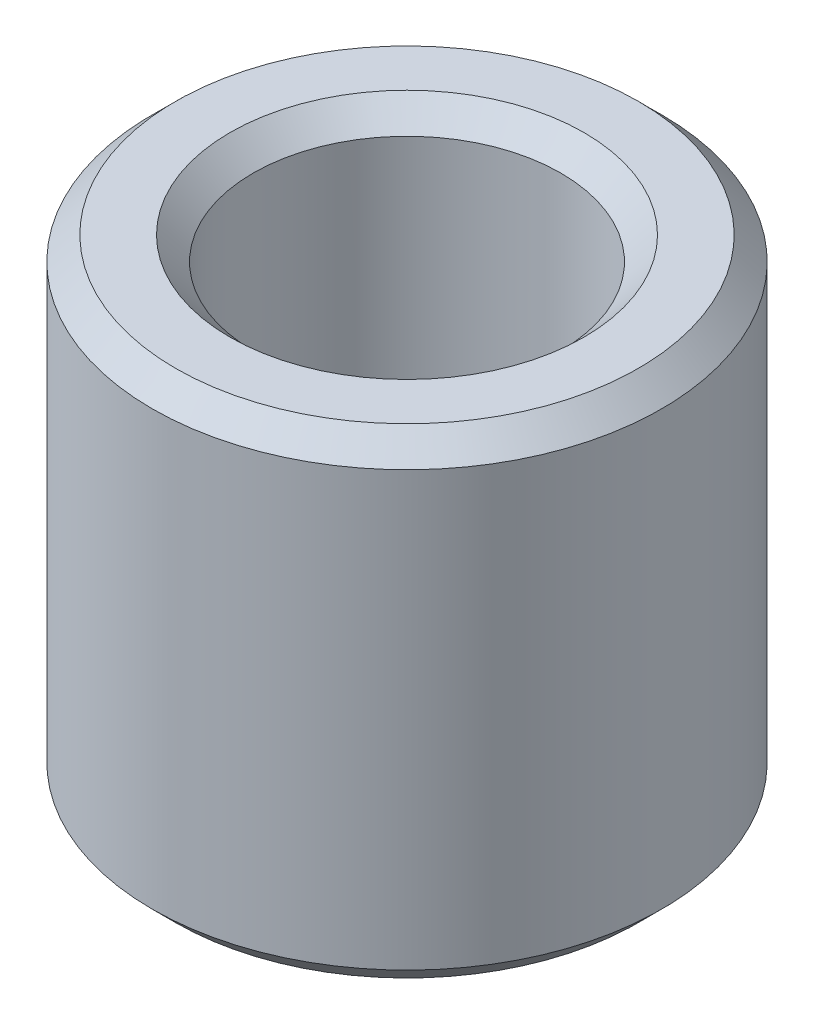
ISO-10303-21;
HEADER;
FILE_DESCRIPTION(('STEP AP214'),'2;1');
FILE_NAME('part.step','',(''),(''),'','','');
FILE_SCHEMA(('AUTOMOTIVE_DESIGN { 1 0 10303 214 1 1 1 1 }'));
ENDSEC;
DATA;
#1=APPLICATION_CONTEXT('core data for automotive mechanical design processes');
#2=APPLICATION_PROTOCOL_DEFINITION('international standard','automotive_design',2000,#1);
#3=PRODUCT_CONTEXT('',#1,'mechanical');
#4=PRODUCT('Part','Part','',(#3));
#5=PRODUCT_RELATED_PRODUCT_CATEGORY('part','',(#4));
#6=PRODUCT_DEFINITION_FORMATION('','',#4);
#7=PRODUCT_DEFINITION_CONTEXT('part definition',#1,'design');
#8=PRODUCT_DEFINITION('design','',#6,#7);
#9=PRODUCT_DEFINITION_SHAPE('','',#8);
#10=(LENGTH_UNIT() NAMED_UNIT(*) SI_UNIT(.MILLI.,.METRE.));
#11=(NAMED_UNIT(*) PLANE_ANGLE_UNIT() SI_UNIT($,.RADIAN.));
#12=(NAMED_UNIT(*) SI_UNIT($,.STERADIAN.) SOLID_ANGLE_UNIT());
#13=UNCERTAINTY_MEASURE_WITH_UNIT(LENGTH_MEASURE(1.E-05),#10,'distance_accuracy_value','');
#14=(GEOMETRIC_REPRESENTATION_CONTEXT(3) GLOBAL_UNCERTAINTY_ASSIGNED_CONTEXT((#13)) GLOBAL_UNIT_ASSIGNED_CONTEXT((#10,
#11,#12)) REPRESENTATION_CONTEXT('',''));
#15=CARTESIAN_POINT('',(0.,0.,0.));
#16=DIRECTION('',(0.,0.,1.));
#17=DIRECTION('',(1.,0.,0.));
#18=AXIS2_PLACEMENT_3D('',#15,#16,#17);
#19=CARTESIAN_POINT('',(0.,37.6944637776325,0.));
#20=DIRECTION('',(0.,-1.,0.));
#21=DIRECTION('',(0.,0.,-1.));
#22=AXIS2_PLACEMENT_3D('',#19,#20,#21);
#23=CYLINDRICAL_SURFACE('',#22,20.);
#24=CARTESIAN_POINT('',(0.,1.83294783832005,0.));
#25=DIRECTION('',(0.,1.,0.));
#26=DIRECTION('',(0.,0.,1.));
#27=AXIS2_PLACEMENT_3D('',#24,#25,#26);
#28=CIRCLE('',#27,20.);
#29=CARTESIAN_POINT('',(0.,1.83294783832005,20.));
#30=VERTEX_POINT('',#29);
#31=EDGE_CURVE('E10',#30,#30,#28,.T.);
#32=ORIENTED_EDGE('',*,*,#31,.T.);
#33=EDGE_LOOP('',(#32));
#34=FACE_BOUND('',#33,.T.);
#35=CARTESIAN_POINT('',(0.,35.8615159393125,0.));
#36=DIRECTION('',(0.,1.,0.));
#37=DIRECTION('',(0.,0.,1.));
#38=AXIS2_PLACEMENT_3D('',#35,#36,#37);
#39=CIRCLE('',#38,20.);
#40=CARTESIAN_POINT('',(0.,35.8615159393125,20.));
#41=VERTEX_POINT('',#40);
#42=EDGE_CURVE('E50',#41,#41,#39,.F.);
#43=ORIENTED_EDGE('',*,*,#42,.T.);
#44=EDGE_LOOP('',(#43));
#45=FACE_BOUND('',#44,.T.);
#46=ADVANCED_FACE('F39',(#34,#45),#23,.T.);
#47=CARTESIAN_POINT('',(0.,37.6944637776325,0.));
#48=DIRECTION('',(0.,1.,0.));
#49=DIRECTION('',(0.,0.,1.));
#50=AXIS2_PLACEMENT_3D('',#47,#48,#49);
#51=PLANE('',#50);
#52=CARTESIAN_POINT('',(0.,37.6944637776325,0.));
#53=DIRECTION('',(0.,1.,0.));
#54=DIRECTION('',(0.,0.,1.));
#55=AXIS2_PLACEMENT_3D('',#52,#53,#54);
#56=CIRCLE('',#55,13.9102106349372);
#57=CARTESIAN_POINT('',(0.,37.6944637776325,13.9102106349372));
#58=VERTEX_POINT('',#57);
#59=EDGE_CURVE('E58',#58,#58,#56,.F.);
#60=ORIENTED_EDGE('',*,*,#59,.T.);
#61=EDGE_LOOP('',(#60));
#62=FACE_BOUND('',#61,.T.);
#63=CARTESIAN_POINT('',(0.,37.6944637776325,0.));
#64=DIRECTION('',(0.,1.,0.));
#65=DIRECTION('',(0.,0.,1.));
#66=AXIS2_PLACEMENT_3D('',#63,#64,#65);
#67=CIRCLE('',#66,18.16705216168);
#68=CARTESIAN_POINT('',(0.,37.6944637776325,18.16705216168));
#69=VERTEX_POINT('',#68);
#70=EDGE_CURVE('E61',#69,#69,#67,.T.);
#71=ORIENTED_EDGE('',*,*,#70,.T.);
#72=EDGE_LOOP('',(#71));
#73=FACE_BOUND('',#72,.T.);
#74=ADVANCED_FACE('F88',(#62,#73),#51,.T.);
#75=CARTESIAN_POINT('',(0.,0.,0.));
#76=DIRECTION('',(0.,1.,0.));
#77=DIRECTION('',(0.,0.,1.));
#78=AXIS2_PLACEMENT_3D('',#75,#76,#77);
#79=PLANE('',#78);
#80=CARTESIAN_POINT('',(0.,0.,0.));
#81=DIRECTION('',(0.,1.,0.));
#82=DIRECTION('',(0.,0.,1.));
#83=AXIS2_PLACEMENT_3D('',#80,#81,#82);
#84=CIRCLE('',#83,13.9102106349372);
#85=CARTESIAN_POINT('',(0.,0.,-13.9102106349372));
#86=VERTEX_POINT('',#85);
#87=EDGE_CURVE('E51',#86,#86,#84,.T.);
#88=ORIENTED_EDGE('',*,*,#87,.T.);
#89=EDGE_LOOP('',(#88));
#90=FACE_BOUND('',#89,.T.);
#91=CARTESIAN_POINT('',(0.,0.,0.));
#92=DIRECTION('',(0.,1.,0.));
#93=DIRECTION('',(0.,0.,1.));
#94=AXIS2_PLACEMENT_3D('',#91,#92,#93);
#95=CIRCLE('',#94,18.1670521616799);
#96=CARTESIAN_POINT('',(0.,0.,18.1670521616799));
#97=VERTEX_POINT('',#96);
#98=EDGE_CURVE('E54',#97,#97,#95,.F.);
#99=ORIENTED_EDGE('',*,*,#98,.T.);
#100=EDGE_LOOP('',(#99));
#101=FACE_BOUND('',#100,.T.);
#102=ADVANCED_FACE('F83',(#90,#101),#79,.F.);
#103=CARTESIAN_POINT('',(0.,37.6944637776325,0.));
#104=DIRECTION('',(0.,-1.,0.));
#105=DIRECTION('',(0.,0.,-1.));
#106=AXIS2_PLACEMENT_3D('',#103,#104,#105);
#107=CYLINDRICAL_SURFACE('',#106,12.0772627966172);
#108=CARTESIAN_POINT('',(0.,35.8615159393125,0.));
#109=DIRECTION('',(0.,1.,0.));
#110=DIRECTION('',(0.,0.,1.));
#111=AXIS2_PLACEMENT_3D('',#108,#109,#110);
#112=CIRCLE('',#111,12.0772627966172);
#113=CARTESIAN_POINT('',(0.,35.8615159393125,-12.0772627966172));
#114=VERTEX_POINT('',#113);
#115=EDGE_CURVE('E67',#114,#114,#112,.T.);
#116=CARTESIAN_POINT('',(0.,1.83294783832006,0.));
#117=DIRECTION('',(0.,1.,0.));
#118=DIRECTION('',(0.,0.,1.));
#119=AXIS2_PLACEMENT_3D('',#116,#117,#118);
#120=CIRCLE('',#119,12.0772627966172);
#121=CARTESIAN_POINT('',(0.,1.83294783832006,-12.0772627966172));
#122=VERTEX_POINT('',#121);
#123=EDGE_CURVE('E69',#122,#122,#120,.F.);
#124=CARTESIAN_POINT('',(0.,35.8615159393125,-12.0772627966172));
#125=CARTESIAN_POINT('',(0.,35.5070516882605,-12.0772627966172));
#126=CARTESIAN_POINT('',(0.,35.1525874372085,-12.0772627966172));
#127=CARTESIAN_POINT('',(0.,34.4436589351045,-12.0772627966172));
#128=CARTESIAN_POINT('',(0.,34.0891946840525,-12.0772627966172));
#129=CARTESIAN_POINT('',(0.,33.3802661819485,-12.0772627966172));
#130=CARTESIAN_POINT('',(0.,33.0258019308965,-12.0772627966172));
#131=CARTESIAN_POINT('',(0.,32.3168734287925,-12.0772627966172));
#132=CARTESIAN_POINT('',(0.,31.9624091777405,-12.0772627966172));
#133=CARTESIAN_POINT('',(0.,31.2534806756365,-12.0772627966172));
#134=CARTESIAN_POINT('',(0.,30.8990164245845,-12.0772627966172));
#135=CARTESIAN_POINT('',(0.,30.1900879224804,-12.0772627966172));
#136=CARTESIAN_POINT('',(0.,29.8356236714284,-12.0772627966172));
#137=CARTESIAN_POINT('',(0.,29.1266951693244,-12.0772627966172));
#138=CARTESIAN_POINT('',(0.,28.7722309182724,-12.0772627966172));
#139=CARTESIAN_POINT('',(0.,28.0633024161684,-12.0772627966172));
#140=CARTESIAN_POINT('',(0.,27.7088381651164,-12.0772627966172));
#141=CARTESIAN_POINT('',(0.,26.9999096630124,-12.0772627966172));
#142=CARTESIAN_POINT('',(0.,26.6454454119604,-12.0772627966172));
#143=CARTESIAN_POINT('',(0.,25.9365169098564,-12.0772627966172));
#144=CARTESIAN_POINT('',(0.,25.5820526588044,-12.0772627966172));
#145=CARTESIAN_POINT('',(0.,24.8731241567004,-12.0772627966172));
#146=CARTESIAN_POINT('',(0.,24.5186599056484,-12.0772627966172));
#147=CARTESIAN_POINT('',(0.,23.8097314035444,-12.0772627966172));
#148=CARTESIAN_POINT('',(0.,23.4552671524924,-12.0772627966172));
#149=CARTESIAN_POINT('',(0.,22.7463386503883,-12.0772627966172));
#150=CARTESIAN_POINT('',(0.,22.3918743993363,-12.0772627966172));
#151=CARTESIAN_POINT('',(0.,21.6829458972323,-12.0772627966172));
#152=CARTESIAN_POINT('',(0.,21.3284816461803,-12.0772627966172));
#153=CARTESIAN_POINT('',(0.,20.6195531440763,-12.0772627966172));
#154=CARTESIAN_POINT('',(0.,20.2650888930243,-12.0772627966172));
#155=CARTESIAN_POINT('',(0.,19.5561603909203,-12.0772627966172));
#156=CARTESIAN_POINT('',(0.,19.2016961398683,-12.0772627966172));
#157=CARTESIAN_POINT('',(0.,18.4927676377643,-12.0772627966172));
#158=CARTESIAN_POINT('',(0.,18.1383033867123,-12.0772627966172));
#159=CARTESIAN_POINT('',(0.,17.4293748846083,-12.0772627966172));
#160=CARTESIAN_POINT('',(0.,17.0749106335563,-12.0772627966172));
#161=CARTESIAN_POINT('',(0.,16.3659821314523,-12.0772627966172));
#162=CARTESIAN_POINT('',(0.,16.0115178804003,-12.0772627966172));
#163=CARTESIAN_POINT('',(0.,15.3025893782962,-12.0772627966172));
#164=CARTESIAN_POINT('',(0.,14.9481251272442,-12.0772627966172));
#165=CARTESIAN_POINT('',(0.,14.2391966251402,-12.0772627966172));
#166=CARTESIAN_POINT('',(0.,13.8847323740882,-12.0772627966172));
#167=CARTESIAN_POINT('',(0.,13.1758038719842,-12.0772627966172));
#168=CARTESIAN_POINT('',(0.,12.8213396209322,-12.0772627966172));
#169=CARTESIAN_POINT('',(0.,12.1124111188282,-12.0772627966172));
#170=CARTESIAN_POINT('',(0.,11.7579468677762,-12.0772627966172));
#171=CARTESIAN_POINT('',(0.,11.0490183656722,-12.0772627966172));
#172=CARTESIAN_POINT('',(0.,10.6945541146202,-12.0772627966172));
#173=CARTESIAN_POINT('',(0.,9.98562561251618,-12.0772627966172));
#174=CARTESIAN_POINT('',(0.,9.63116136146417,-12.0772627966172));
#175=CARTESIAN_POINT('',(0.,8.92223285936016,-12.0772627966172));
#176=CARTESIAN_POINT('',(0.,8.56776860830816,-12.0772627966172));
#177=CARTESIAN_POINT('',(0.,7.85884010620414,-12.0772627966172));
#178=CARTESIAN_POINT('',(0.,7.50437585515214,-12.0772627966172));
#179=CARTESIAN_POINT('',(0.,6.79544735304813,-12.0772627966172));
#180=CARTESIAN_POINT('',(0.,6.44098310199613,-12.0772627966172));
#181=CARTESIAN_POINT('',(0.,5.73205459989212,-12.0772627966172));
#182=CARTESIAN_POINT('',(0.,5.37759034884011,-12.0772627966172));
#183=CARTESIAN_POINT('',(0.,4.6686618467361,-12.0772627966172));
#184=CARTESIAN_POINT('',(0.,4.31419759568409,-12.0772627966172));
#185=CARTESIAN_POINT('',(0.,3.60526909358008,-12.0772627966172));
#186=CARTESIAN_POINT('',(0.,3.25080484252808,-12.0772627966172));
#187=CARTESIAN_POINT('',(0.,2.54187634042407,-12.0772627966172));
#188=CARTESIAN_POINT('',(0.,2.18741208937207,-12.0772627966172));
#189=CARTESIAN_POINT('',(0.,1.83294783832006,-12.0772627966172));
#190=B_SPLINE_CURVE_WITH_KNOTS('',3,(#124,#125,#126,#127,#128,#129,#130,#131,#132,#133,#134,
#135,#136,#137,#138,#139,#140,#141,#142,#143,#144,#145,#146,#147,#148,#149,#150,#151,#152,#153,
#154,#155,#156,#157,#158,#159,#160,#161,#162,#163,#164,#165,#166,#167,#168,#169,#170,#171,#172,
#173,#174,#175,#176,#177,#178,#179,#180,#181,#182,#183,#184,#185,#186,#187,#188,#189),
.UNSPECIFIED.,.F.,.F.,(4,2,2,2,2,2,2,2,2,2,2,2,2,2,2,2,2,2,2,2,2,2,2,2,2,2,2,2,2,2,2,2,4),(0.,
1.06339275315602,2.12678550631203,3.19017825946805,4.25357101262406,5.31696376578008,
6.38035651893609,7.44374927209211,8.50714202524812,9.57053477840413,10.6339275315601,
11.6973202847162,12.7607130378722,13.8241057910282,14.8874985441842,15.9508912973402,
17.0142840504962,18.0776768036522,19.1410695568083,20.2044623099643,21.2678550631203,
22.3312478162763,23.3946405694323,24.4580333225883,25.5214260757443,26.5848188289004,
27.6482115820564,28.7116043352124,29.7749970883684,30.8383898415244,31.9017825946804,
32.9651753478364,34.0285681009925),.UNSPECIFIED.);
#191=EDGE_CURVE('BSEAM71',#114,#122,#190,.T.);
#192=ORIENTED_EDGE('',*,*,#115,.T.);
#193=ORIENTED_EDGE('',*,*,#123,.T.);
#194=ORIENTED_EDGE('',*,*,#191,.T.);
#195=ORIENTED_EDGE('',*,*,#191,.F.);
#196=EDGE_LOOP('',(#192,#194,#193,#195));
#197=FACE_BOUND('',#196,.T.);
#198=ADVANCED_FACE('F71',(#197),#107,.F.);
#199=CARTESIAN_POINT('',(0.,35.8615159393125,0.));
#200=DIRECTION('',(0.,1.,0.));
#201=DIRECTION('',(0.,0.,1.));
#202=AXIS2_PLACEMENT_3D('',#199,#200,#201);
#203=CONICAL_SURFACE('',#202,12.0772627966172,0.785398163397452);
#204=ORIENTED_EDGE('',*,*,#59,.F.);
#205=EDGE_LOOP('',(#204));
#206=FACE_BOUND('',#205,.T.);
#207=ORIENTED_EDGE('',*,*,#115,.F.);
#208=EDGE_LOOP('',(#207));
#209=FACE_BOUND('',#208,.T.);
#210=ADVANCED_FACE('F77',(#206,#209),#203,.F.);
#211=CARTESIAN_POINT('',(0.,0.,0.));
#212=DIRECTION('',(0.,-1.,0.));
#213=DIRECTION('',(0.,0.,-1.));
#214=AXIS2_PLACEMENT_3D('',#211,#212,#213);
#215=CONICAL_SURFACE('',#214,13.9102106349372,0.785398163397443);
#216=CARTESIAN_POINT('',(0.,1.83294783832006,-12.0772627966172));
#217=CARTESIAN_POINT('',(0.,1.81385463167089,-12.0963560032663));
#218=CARTESIAN_POINT('',(0.,1.79476142502173,-12.1154492099155));
#219=CARTESIAN_POINT('',(0.,1.75657501172339,-12.1536356232138));
#220=CARTESIAN_POINT('',(0.,1.73748180507422,-12.172728829863));
#221=CARTESIAN_POINT('',(0.,1.69929539177589,-12.2109152431613));
#222=CARTESIAN_POINT('',(0.,1.68020218512672,-12.2300084498105));
#223=CARTESIAN_POINT('',(0.,1.64201577182839,-12.2681948631088));
#224=CARTESIAN_POINT('',(0.,1.62292256517922,-12.287288069758));
#225=CARTESIAN_POINT('',(0.,1.58473615188089,-12.3254744830563));
#226=CARTESIAN_POINT('',(0.,1.56564294523172,-12.3445676897055));
#227=CARTESIAN_POINT('',(0.,1.52745653193338,-12.3827541030038));
#228=CARTESIAN_POINT('',(0.,1.50836332528422,-12.401847309653));
#229=CARTESIAN_POINT('',(0.,1.47017691198588,-12.4400337229513));
#230=CARTESIAN_POINT('',(0.,1.45108370533671,-12.4591269296005));
#231=CARTESIAN_POINT('',(0.,1.41289729203838,-12.4973133428988));
#232=CARTESIAN_POINT('',(0.,1.39380408538921,-12.516406549548));
#233=CARTESIAN_POINT('',(0.,1.35561767209088,-12.5545929628463));
#234=CARTESIAN_POINT('',(0.,1.33652446544171,-12.5736861694955));
#235=CARTESIAN_POINT('',(0.,1.29833805214338,-12.6118725827938));
#236=CARTESIAN_POINT('',(0.,1.27924484549421,-12.630965789443));
#237=CARTESIAN_POINT('',(0.,1.24105843219587,-12.6691522027413));
#238=CARTESIAN_POINT('',(0.,1.22196522554671,-12.6882454093905));
#239=CARTESIAN_POINT('',(0.,1.18377881224837,-12.7264318226888));
#240=CARTESIAN_POINT('',(0.,1.1646856055992,-12.745525029338));
#241=CARTESIAN_POINT('',(0.,1.12649919230087,-12.7837114426363));
#242=CARTESIAN_POINT('',(0.,1.1074059856517,-12.8028046492855));
#243=CARTESIAN_POINT('',(0.,1.06921957235337,-12.8409910625838));
#244=CARTESIAN_POINT('',(0.,1.0501263657042,-12.860084269233));
#245=CARTESIAN_POINT('',(0.,1.01193995240587,-12.8982706825313));
#246=CARTESIAN_POINT('',(0.,0.9928467457567,-12.9173638891805));
#247=CARTESIAN_POINT('',(0.,0.954660332458365,-12.9555503024788));
#248=CARTESIAN_POINT('',(0.,0.935567125809197,-12.974643509128));
#249=CARTESIAN_POINT('',(0.,0.897380712510863,-13.0128299224263));
#250=CARTESIAN_POINT('',(0.,0.878287505861696,-13.0319231290755));
#251=CARTESIAN_POINT('',(0.,0.840101092563361,-13.0701095423738));
#252=CARTESIAN_POINT('',(0.,0.821007885914194,-13.089202749023));
#253=CARTESIAN_POINT('',(0.,0.782821472615859,-13.1273891623213));
#254=CARTESIAN_POINT('',(0.,0.763728265966692,-13.1464823689705));
#255=CARTESIAN_POINT('',(0.,0.725541852668357,-13.1846687822689));
#256=CARTESIAN_POINT('',(0.,0.70644864601919,-13.203761988918));
#257=CARTESIAN_POINT('',(0.,0.668262232720855,-13.2419484022163));
#258=CARTESIAN_POINT('',(0.,0.649169026071688,-13.2610416088655));
#259=CARTESIAN_POINT('',(0.,0.610982612773353,-13.2992280221639));
#260=CARTESIAN_POINT('',(0.,0.591889406124186,-13.318321228813));
#261=CARTESIAN_POINT('',(0.,0.553702992825852,-13.3565076421114));
#262=CARTESIAN_POINT('',(0.,0.534609786176684,-13.3756008487605));
#263=CARTESIAN_POINT('',(0.,0.49642337287835,-13.4137872620589));
#264=CARTESIAN_POINT('',(0.,0.477330166229183,-13.432880468708));
#265=CARTESIAN_POINT('',(0.,0.439143752930848,-13.4710668820064));
#266=CARTESIAN_POINT('',(0.,0.42005054628168,-13.4901600886555));
#267=CARTESIAN_POINT('',(0.,0.381864132983346,-13.5283465019539));
#268=CARTESIAN_POINT('',(0.,0.362770926334179,-13.547439708603));
#269=CARTESIAN_POINT('',(0.,0.324584513035844,-13.5856261219014));
#270=CARTESIAN_POINT('',(0.,0.305491306386677,-13.6047193285505));
#271=CARTESIAN_POINT('',(0.,0.267304893088342,-13.6429057418489));
#272=CARTESIAN_POINT('',(0.,0.248211686439175,-13.661998948498));
#273=CARTESIAN_POINT('',(0.,0.21002527314084,-13.7001853617964));
#274=CARTESIAN_POINT('',(0.,0.190932066491673,-13.7192785684455));
#275=CARTESIAN_POINT('',(0.,0.152745653193338,-13.7574649817439));
#276=CARTESIAN_POINT('',(0.,0.133652446544171,-13.776558188393));
#277=CARTESIAN_POINT('',(0.,0.0954660332458363,-13.8147446016914));
#278=CARTESIAN_POINT('',(0.,0.0763728265966691,-13.8338378083405));
#279=CARTESIAN_POINT('',(0.,0.0381864132983347,-13.8720242216389));
#280=CARTESIAN_POINT('',(0.,0.0190932066491675,-13.891117428288));
#281=CARTESIAN_POINT('',(0.,0.,-13.9102106349372));
#282=B_SPLINE_CURVE_WITH_KNOTS('',3,(#216,#217,#218,#219,#220,#221,#222,#223,#224,#225,#226,
#227,#228,#229,#230,#231,#232,#233,#234,#235,#236,#237,#238,#239,#240,#241,#242,#243,#244,#245,
#246,#247,#248,#249,#250,#251,#252,#253,#254,#255,#256,#257,#258,#259,#260,#261,#262,#263,#264,
#265,#266,#267,#268,#269,#270,#271,#272,#273,#274,#275,#276,#277,#278,#279,#280,#281),
.UNSPECIFIED.,.F.,.F.,(4,2,2,2,2,2,2,2,2,2,2,2,2,2,2,2,2,2,2,2,2,2,2,2,2,2,2,2,2,2,2,2,4),(0.,
0.0810056153773335,0.162011230754666,0.243016846131999,0.324022461509333,0.405028076886666,
0.486033692264,0.567039307641332,0.648044923018666,0.729050538395999,0.810056153773333,
0.891061769150666,0.972067384527998,1.05307299990533,1.13407861528267,1.21508423066,
1.29608984603733,1.37709546141466,1.458101076792,1.53910669216933,1.62011230754667,
1.701117922924,1.78212353830133,1.86312915367866,1.944134769056,2.02514038443333,
2.10614599981066,2.187151615188,2.26815723056533,2.34916284594266,2.43016846132,
2.51117407669733,2.59217969207466),.UNSPECIFIED.);
#283=EDGE_CURVE('BSEAM73',#122,#86,#282,.T.);
#284=ORIENTED_EDGE('',*,*,#123,.F.);
#285=ORIENTED_EDGE('',*,*,#87,.F.);
#286=ORIENTED_EDGE('',*,*,#283,.T.);
#287=ORIENTED_EDGE('',*,*,#283,.F.);
#288=EDGE_LOOP('',(#284,#286,#285,#287));
#289=FACE_BOUND('',#288,.T.);
#290=ADVANCED_FACE('F73',(#289),#215,.F.);
#291=CARTESIAN_POINT('',(0.,1.83294783832005,0.));
#292=DIRECTION('',(0.,1.,0.));
#293=DIRECTION('',(0.,0.,1.));
#294=AXIS2_PLACEMENT_3D('',#291,#292,#293);
#295=CONICAL_SURFACE('',#294,20.,0.785398163397452);
#296=ORIENTED_EDGE('',*,*,#98,.F.);
#297=EDGE_LOOP('',(#296));
#298=FACE_BOUND('',#297,.T.);
#299=ORIENTED_EDGE('',*,*,#31,.F.);
#300=EDGE_LOOP('',(#299));
#301=FACE_BOUND('',#300,.T.);
#302=ADVANCED_FACE('F76',(#298,#301),#295,.T.);
#303=CARTESIAN_POINT('',(0.,37.6944637776325,0.));
#304=DIRECTION('',(0.,-1.,0.));
#305=DIRECTION('',(0.,0.,-1.));
#306=AXIS2_PLACEMENT_3D('',#303,#304,#305);
#307=CONICAL_SURFACE('',#306,18.16705216168,0.785398163397444);
#308=ORIENTED_EDGE('',*,*,#42,.F.);
#309=EDGE_LOOP('',(#308));
#310=FACE_BOUND('',#309,.T.);
#311=ORIENTED_EDGE('',*,*,#70,.F.);
#312=EDGE_LOOP('',(#311));
#313=FACE_BOUND('',#312,.T.);
#314=ADVANCED_FACE('F45',(#310,#313),#307,.T.);
#315=CLOSED_SHELL('',(#46,#74,#102,#198,#210,#290,#302,#314));
#316=MANIFOLD_SOLID_BREP('B2',#315);
#317=ADVANCED_BREP_SHAPE_REPRESENTATION('',(#18,#316),#14);
#318=SHAPE_DEFINITION_REPRESENTATION(#9,#317);
ENDSEC;
END-ISO-10303-21;
